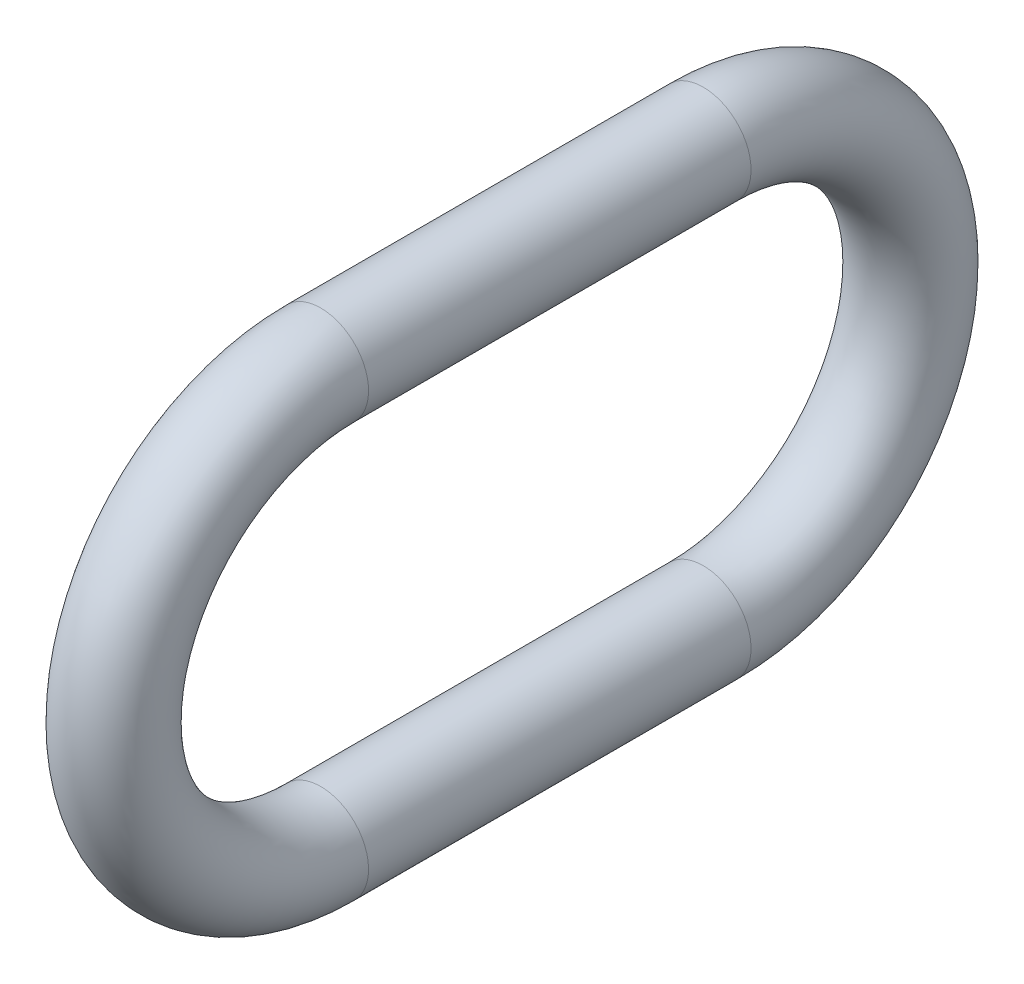
ISO-10303-21;
HEADER;
FILE_DESCRIPTION(('STEP AP214'),'2;1');
FILE_NAME('part.step','',(''),(''),'','','');
FILE_SCHEMA(('AUTOMOTIVE_DESIGN { 1 0 10303 214 1 1 1 1 }'));
ENDSEC;
DATA;
#1=APPLICATION_CONTEXT('core data for automotive mechanical design processes');
#2=APPLICATION_PROTOCOL_DEFINITION('international standard','automotive_design',2000,#1);
#3=PRODUCT_CONTEXT('',#1,'mechanical');
#4=PRODUCT('Part','Part','',(#3));
#5=PRODUCT_RELATED_PRODUCT_CATEGORY('part','',(#4));
#6=PRODUCT_DEFINITION_FORMATION('','',#4);
#7=PRODUCT_DEFINITION_CONTEXT('part definition',#1,'design');
#8=PRODUCT_DEFINITION('design','',#6,#7);
#9=PRODUCT_DEFINITION_SHAPE('','',#8);
#10=(LENGTH_UNIT() NAMED_UNIT(*) SI_UNIT(.MILLI.,.METRE.));
#11=(NAMED_UNIT(*) PLANE_ANGLE_UNIT() SI_UNIT($,.RADIAN.));
#12=(NAMED_UNIT(*) SI_UNIT($,.STERADIAN.) SOLID_ANGLE_UNIT());
#13=UNCERTAINTY_MEASURE_WITH_UNIT(LENGTH_MEASURE(1.E-05),#10,'distance_accuracy_value','');
#14=(GEOMETRIC_REPRESENTATION_CONTEXT(3) GLOBAL_UNCERTAINTY_ASSIGNED_CONTEXT((#13)) GLOBAL_UNIT_ASSIGNED_CONTEXT((#10,
#11,#12)) REPRESENTATION_CONTEXT('',''));
#15=CARTESIAN_POINT('',(0.,0.,0.));
#16=DIRECTION('',(0.,0.,1.));
#17=DIRECTION('',(1.,0.,0.));
#18=AXIS2_PLACEMENT_3D('',#15,#16,#17);
#19=CARTESIAN_POINT('',(0.,0.,-31.75));
#20=DIRECTION('',(-1.,0.,0.));
#21=DIRECTION('',(0.,0.,1.));
#22=AXIS2_PLACEMENT_3D('',#19,#20,#21);
#23=TOROIDAL_SURFACE('',#22,10.31875,2.38125);
#24=CARTESIAN_POINT('',(0.,10.31875,-31.75));
#25=DIRECTION('',(0.,0.,1.));
#26=DIRECTION('',(1.,0.,0.));
#27=AXIS2_PLACEMENT_3D('',#24,#25,#26);
#28=CIRCLE('',#27,2.38125);
#29=CARTESIAN_POINT('',(0.,12.7,-31.75));
#30=VERTEX_POINT('',#29);
#31=EDGE_CURVE('E57',#30,#30,#28,.T.);
#32=CARTESIAN_POINT('',(0.,-10.31875,-31.75));
#33=DIRECTION('',(0.,0.,-1.));
#34=DIRECTION('',(1.,0.,0.));
#35=AXIS2_PLACEMENT_3D('',#32,#33,#34);
#36=CIRCLE('',#35,2.38125);
#37=CARTESIAN_POINT('',(0.,-12.7,-31.75));
#38=VERTEX_POINT('',#37);
#39=EDGE_CURVE('E53',#38,#38,#36,.T.);
#40=CARTESIAN_POINT('',(0.,0.,-31.75));
#41=DIRECTION('',(-1.,0.,0.));
#42=DIRECTION('',(0.,0.,1.));
#43=AXIS2_PLACEMENT_3D('',#40,#41,#42);
#44=CIRCLE('',#43,12.7);
#45=EDGE_CURVE('',#30,#38,#44,.T.);
#46=ORIENTED_EDGE('',*,*,#31,.F.);
#47=ORIENTED_EDGE('',*,*,#39,.T.);
#48=ORIENTED_EDGE('',*,*,#45,.T.);
#49=ORIENTED_EDGE('',*,*,#45,.F.);
#50=EDGE_LOOP('',(#46,#48,#47,#49));
#51=FACE_BOUND('',#50,.T.);
#52=ADVANCED_FACE('F42',(#51),#23,.T.);
#53=CARTESIAN_POINT('',(0.,-10.31875,-31.75));
#54=DIRECTION('',(0.,0.,1.));
#55=DIRECTION('',(1.,0.,0.));
#56=AXIS2_PLACEMENT_3D('',#53,#54,#55);
#57=CYLINDRICAL_SURFACE('',#56,2.38125);
#58=CARTESIAN_POINT('',(0.,-10.31875,-12.7));
#59=DIRECTION('',(0.,0.,-1.));
#60=DIRECTION('',(1.,0.,0.));
#61=AXIS2_PLACEMENT_3D('',#58,#59,#60);
#62=CIRCLE('',#61,2.38125);
#63=CARTESIAN_POINT('',(0.,-12.7,-12.7));
#64=VERTEX_POINT('',#63);
#65=EDGE_CURVE('E49',#64,#64,#62,.T.);
#66=ORIENTED_EDGE('',*,*,#65,.T.);
#67=EDGE_LOOP('',(#66));
#68=FACE_BOUND('',#67,.T.);
#69=ORIENTED_EDGE('',*,*,#39,.F.);
#70=EDGE_LOOP('',(#69));
#71=FACE_BOUND('',#70,.T.);
#72=ADVANCED_FACE('F66',(#68,#71),#57,.T.);
#73=CARTESIAN_POINT('',(0.,0.,-12.7));
#74=DIRECTION('',(-1.,0.,0.));
#75=DIRECTION('',(0.,0.,1.));
#76=AXIS2_PLACEMENT_3D('',#73,#74,#75);
#77=TOROIDAL_SURFACE('',#76,10.31875,2.38125);
#78=CARTESIAN_POINT('',(0.,10.31875,-12.7));
#79=DIRECTION('',(0.,0.,1.));
#80=DIRECTION('',(1.,0.,0.));
#81=AXIS2_PLACEMENT_3D('',#78,#79,#80);
#82=CIRCLE('',#81,2.38125);
#83=CARTESIAN_POINT('',(0.,12.7,-12.7));
#84=VERTEX_POINT('',#83);
#85=EDGE_CURVE('E11',#84,#84,#82,.T.);
#86=CARTESIAN_POINT('',(0.,0.,-12.7));
#87=DIRECTION('',(-1.,0.,0.));
#88=DIRECTION('',(0.,0.,1.));
#89=AXIS2_PLACEMENT_3D('',#86,#87,#88);
#90=CIRCLE('',#89,12.7);
#91=EDGE_CURVE('',#64,#84,#90,.T.);
#92=ORIENTED_EDGE('',*,*,#65,.F.);
#93=ORIENTED_EDGE('',*,*,#85,.T.);
#94=ORIENTED_EDGE('',*,*,#91,.T.);
#95=ORIENTED_EDGE('',*,*,#91,.F.);
#96=EDGE_LOOP('',(#92,#94,#93,#95));
#97=FACE_BOUND('',#96,.T.);
#98=ADVANCED_FACE('F72',(#97),#77,.T.);
#99=CARTESIAN_POINT('',(0.,10.31875,-12.7));
#100=DIRECTION('',(0.,0.,-1.));
#101=DIRECTION('',(-1.,0.,0.));
#102=AXIS2_PLACEMENT_3D('',#99,#100,#101);
#103=CYLINDRICAL_SURFACE('',#102,2.38125);
#104=ORIENTED_EDGE('',*,*,#31,.T.);
#105=EDGE_LOOP('',(#104));
#106=FACE_BOUND('',#105,.T.);
#107=ORIENTED_EDGE('',*,*,#85,.F.);
#108=EDGE_LOOP('',(#107));
#109=FACE_BOUND('',#108,.T.);
#110=ADVANCED_FACE('F44',(#106,#109),#103,.T.);
#111=CLOSED_SHELL('',(#52,#72,#98,#110));
#112=MANIFOLD_SOLID_BREP('B2',#111);
#113=ADVANCED_BREP_SHAPE_REPRESENTATION('',(#18,#112),#14);
#114=SHAPE_DEFINITION_REPRESENTATION(#9,#113);
ENDSEC;
END-ISO-10303-21;
